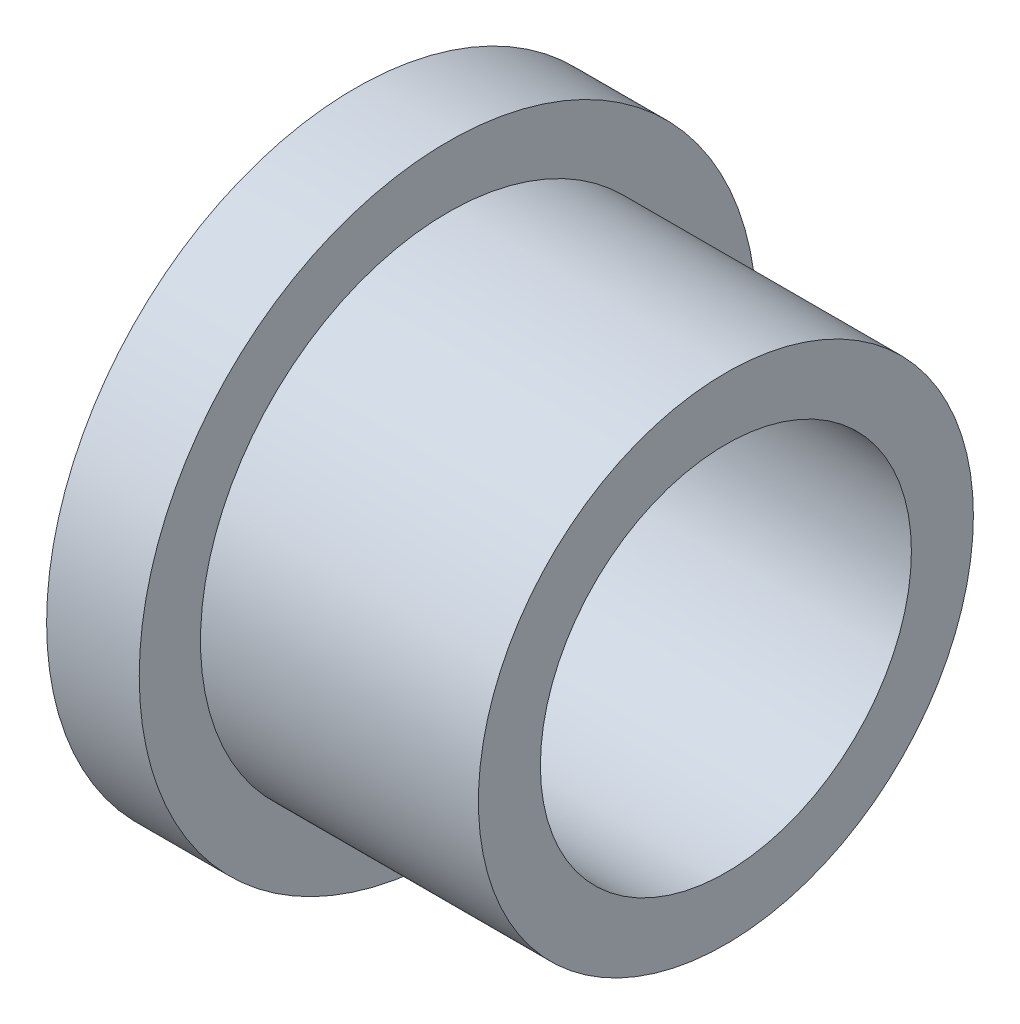
ISO-10303-21;
HEADER;
FILE_DESCRIPTION(('STEP AP214'),'2;1');
FILE_NAME('part.step','',(''),(''),'','','');
FILE_SCHEMA(('AUTOMOTIVE_DESIGN { 1 0 10303 214 1 1 1 1 }'));
ENDSEC;
DATA;
#1=APPLICATION_CONTEXT('core data for automotive mechanical design processes');
#2=APPLICATION_PROTOCOL_DEFINITION('international standard','automotive_design',2000,#1);
#3=PRODUCT_CONTEXT('',#1,'mechanical');
#4=PRODUCT('Part','Part','',(#3));
#5=PRODUCT_RELATED_PRODUCT_CATEGORY('part','',(#4));
#6=PRODUCT_DEFINITION_FORMATION('','',#4);
#7=PRODUCT_DEFINITION_CONTEXT('part definition',#1,'design');
#8=PRODUCT_DEFINITION('design','',#6,#7);
#9=PRODUCT_DEFINITION_SHAPE('','',#8);
#10=(LENGTH_UNIT() NAMED_UNIT(*) SI_UNIT(.MILLI.,.METRE.));
#11=(NAMED_UNIT(*) PLANE_ANGLE_UNIT() SI_UNIT($,.RADIAN.));
#12=(NAMED_UNIT(*) SI_UNIT($,.STERADIAN.) SOLID_ANGLE_UNIT());
#13=UNCERTAINTY_MEASURE_WITH_UNIT(LENGTH_MEASURE(1.E-05),#10,'distance_accuracy_value','');
#14=(GEOMETRIC_REPRESENTATION_CONTEXT(3) GLOBAL_UNCERTAINTY_ASSIGNED_CONTEXT((#13)) GLOBAL_UNIT_ASSIGNED_CONTEXT((#10,
#11,#12)) REPRESENTATION_CONTEXT('',''));
#15=CARTESIAN_POINT('',(0.,0.,0.));
#16=DIRECTION('',(0.,0.,1.));
#17=DIRECTION('',(1.,0.,0.));
#18=AXIS2_PLACEMENT_3D('',#15,#16,#17);
#19=CARTESIAN_POINT('',(4.7625,0.,0.));
#20=DIRECTION('',(1.,0.,0.));
#21=DIRECTION('',(0.,0.,-1.));
#22=AXIS2_PLACEMENT_3D('',#19,#20,#21);
#23=PLANE('',#22);
#24=CARTESIAN_POINT('',(4.7625,0.,0.));
#25=DIRECTION('',(1.,0.,0.));
#26=DIRECTION('',(0.,0.,-1.));
#27=AXIS2_PLACEMENT_3D('',#24,#25,#26);
#28=CIRCLE('',#27,15.875);
#29=CARTESIAN_POINT('',(4.7625,0.,-15.875));
#30=VERTEX_POINT('',#29);
#31=EDGE_CURVE('E11',#30,#30,#28,.T.);
#32=ORIENTED_EDGE('',*,*,#31,.T.);
#33=EDGE_LOOP('',(#32));
#34=FACE_BOUND('',#33,.T.);
#35=CARTESIAN_POINT('',(4.7625,0.,0.));
#36=DIRECTION('',(1.,0.,0.));
#37=DIRECTION('',(0.,0.,-1.));
#38=AXIS2_PLACEMENT_3D('',#35,#36,#37);
#39=CIRCLE('',#38,12.7254);
#40=CARTESIAN_POINT('',(4.7625,0.,-12.7254));
#41=VERTEX_POINT('',#40);
#42=EDGE_CURVE('E61',#41,#41,#39,.F.);
#43=ORIENTED_EDGE('',*,*,#42,.T.);
#44=EDGE_LOOP('',(#43));
#45=FACE_BOUND('',#44,.T.);
#46=ADVANCED_FACE('F46',(#34,#45),#23,.T.);
#47=CARTESIAN_POINT('',(0.,0.,0.));
#48=DIRECTION('',(1.,0.,0.));
#49=DIRECTION('',(0.,0.,-1.));
#50=AXIS2_PLACEMENT_3D('',#47,#48,#49);
#51=PLANE('',#50);
#52=CARTESIAN_POINT('',(0.,0.,0.));
#53=DIRECTION('',(1.,0.,0.));
#54=DIRECTION('',(0.,0.,-1.));
#55=AXIS2_PLACEMENT_3D('',#52,#53,#54);
#56=CIRCLE('',#55,9.5377);
#57=CARTESIAN_POINT('',(0.,0.,-9.5377));
#58=VERTEX_POINT('',#57);
#59=EDGE_CURVE('E57',#58,#58,#56,.T.);
#60=ORIENTED_EDGE('',*,*,#59,.T.);
#61=EDGE_LOOP('',(#60));
#62=FACE_BOUND('',#61,.T.);
#63=CARTESIAN_POINT('',(0.,0.,0.));
#64=DIRECTION('',(1.,0.,0.));
#65=DIRECTION('',(0.,0.,-1.));
#66=AXIS2_PLACEMENT_3D('',#63,#64,#65);
#67=CIRCLE('',#66,15.875);
#68=CARTESIAN_POINT('',(0.,0.,-15.875));
#69=VERTEX_POINT('',#68);
#70=EDGE_CURVE('E50',#69,#69,#67,.T.);
#71=ORIENTED_EDGE('',*,*,#70,.F.);
#72=EDGE_LOOP('',(#71));
#73=FACE_BOUND('',#72,.T.);
#74=ADVANCED_FACE('F87',(#62,#73),#51,.F.);
#75=CARTESIAN_POINT('',(4.7625,0.,0.));
#76=DIRECTION('',(-1.,0.,0.));
#77=DIRECTION('',(0.,0.,1.));
#78=AXIS2_PLACEMENT_3D('',#75,#76,#77);
#79=CYLINDRICAL_SURFACE('',#78,15.875);
#80=ORIENTED_EDGE('',*,*,#31,.F.);
#81=EDGE_LOOP('',(#80));
#82=FACE_BOUND('',#81,.T.);
#83=ORIENTED_EDGE('',*,*,#70,.T.);
#84=EDGE_LOOP('',(#83));
#85=FACE_BOUND('',#84,.T.);
#86=ADVANCED_FACE('F48',(#82,#85),#79,.T.);
#87=CARTESIAN_POINT('',(4.7625,0.,0.));
#88=DIRECTION('',(-1.,0.,0.));
#89=DIRECTION('',(0.,0.,1.));
#90=AXIS2_PLACEMENT_3D('',#87,#88,#89);
#91=CYLINDRICAL_SURFACE('',#90,9.5377);
#92=ORIENTED_EDGE('',*,*,#59,.F.);
#93=EDGE_LOOP('',(#92));
#94=FACE_BOUND('',#93,.T.);
#95=CARTESIAN_POINT('',(19.05,0.,0.));
#96=DIRECTION('',(1.,0.,0.));
#97=DIRECTION('',(0.,0.,-1.));
#98=AXIS2_PLACEMENT_3D('',#95,#96,#97);
#99=CIRCLE('',#98,9.5377);
#100=CARTESIAN_POINT('',(19.05,0.,-9.5377));
#101=VERTEX_POINT('',#100);
#102=EDGE_CURVE('E67',#101,#101,#99,.T.);
#103=ORIENTED_EDGE('',*,*,#102,.T.);
#104=EDGE_LOOP('',(#103));
#105=FACE_BOUND('',#104,.T.);
#106=ADVANCED_FACE('F71',(#94,#105),#91,.F.);
#107=CARTESIAN_POINT('',(19.05,0.,0.));
#108=DIRECTION('',(1.,0.,0.));
#109=DIRECTION('',(0.,0.,-1.));
#110=AXIS2_PLACEMENT_3D('',#107,#108,#109);
#111=PLANE('',#110);
#112=CARTESIAN_POINT('',(19.05,0.,0.));
#113=DIRECTION('',(1.,0.,0.));
#114=DIRECTION('',(0.,0.,-1.));
#115=AXIS2_PLACEMENT_3D('',#112,#113,#114);
#116=CIRCLE('',#115,12.7254);
#117=CARTESIAN_POINT('',(19.05,0.,-12.7254));
#118=VERTEX_POINT('',#117);
#119=EDGE_CURVE('E64',#118,#118,#116,.T.);
#120=ORIENTED_EDGE('',*,*,#119,.T.);
#121=EDGE_LOOP('',(#120));
#122=FACE_BOUND('',#121,.T.);
#123=ORIENTED_EDGE('',*,*,#102,.F.);
#124=EDGE_LOOP('',(#123));
#125=FACE_BOUND('',#124,.T.);
#126=ADVANCED_FACE('F73',(#122,#125),#111,.T.);
#127=CARTESIAN_POINT('',(19.05,0.,0.));
#128=DIRECTION('',(-1.,0.,0.));
#129=DIRECTION('',(0.,0.,1.));
#130=AXIS2_PLACEMENT_3D('',#127,#128,#129);
#131=CYLINDRICAL_SURFACE('',#130,12.7254);
#132=ORIENTED_EDGE('',*,*,#42,.F.);
#133=EDGE_LOOP('',(#132));
#134=FACE_BOUND('',#133,.T.);
#135=ORIENTED_EDGE('',*,*,#119,.F.);
#136=EDGE_LOOP('',(#135));
#137=FACE_BOUND('',#136,.T.);
#138=ADVANCED_FACE('F75',(#134,#137),#131,.T.);
#139=CLOSED_SHELL('',(#46,#74,#86,#106,#126,#138));
#140=MANIFOLD_SOLID_BREP('B2',#139);
#141=ADVANCED_BREP_SHAPE_REPRESENTATION('',(#18,#140),#14);
#142=SHAPE_DEFINITION_REPRESENTATION(#9,#141);
ENDSEC;
END-ISO-10303-21;
